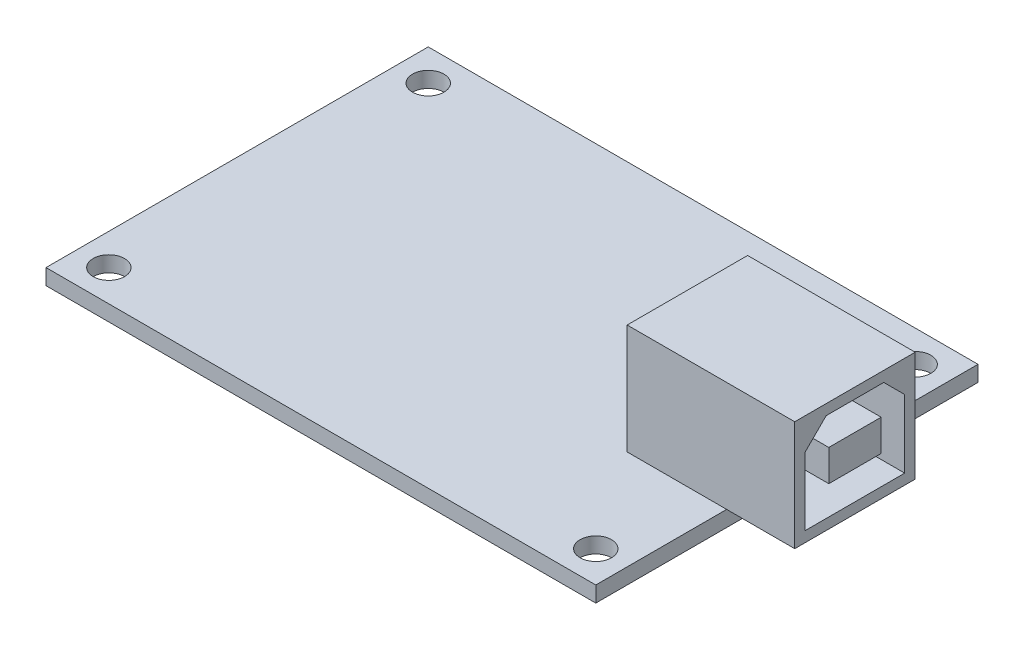
ISO-10303-21;
HEADER;
FILE_DESCRIPTION(('STEP AP214'),'2;1');
FILE_NAME('part.step','',(''),(''),'','','');
FILE_SCHEMA(('AUTOMOTIVE_DESIGN { 1 0 10303 214 1 1 1 1 }'));
ENDSEC;
DATA;
#1=APPLICATION_CONTEXT('core data for automotive mechanical design processes');
#2=APPLICATION_PROTOCOL_DEFINITION('international standard','automotive_design',2000,#1);
#3=PRODUCT_CONTEXT('',#1,'mechanical');
#4=PRODUCT('Part','Part','',(#3));
#5=PRODUCT_RELATED_PRODUCT_CATEGORY('part','',(#4));
#6=PRODUCT_DEFINITION_FORMATION('','',#4);
#7=PRODUCT_DEFINITION_CONTEXT('part definition',#1,'design');
#8=PRODUCT_DEFINITION('design','',#6,#7);
#9=PRODUCT_DEFINITION_SHAPE('','',#8);
#10=(LENGTH_UNIT() NAMED_UNIT(*) SI_UNIT(.MILLI.,.METRE.));
#11=(NAMED_UNIT(*) PLANE_ANGLE_UNIT() SI_UNIT($,.RADIAN.));
#12=(NAMED_UNIT(*) SI_UNIT($,.STERADIAN.) SOLID_ANGLE_UNIT());
#13=UNCERTAINTY_MEASURE_WITH_UNIT(LENGTH_MEASURE(1.E-05),#10,'distance_accuracy_value','');
#14=(GEOMETRIC_REPRESENTATION_CONTEXT(3) GLOBAL_UNCERTAINTY_ASSIGNED_CONTEXT((#13)) GLOBAL_UNIT_ASSIGNED_CONTEXT((#10,
#11,#12)) REPRESENTATION_CONTEXT('',''));
#15=CARTESIAN_POINT('',(0.,0.,0.));
#16=DIRECTION('',(0.,0.,1.));
#17=DIRECTION('',(1.,0.,0.));
#18=AXIS2_PLACEMENT_3D('',#15,#16,#17);
#19=CARTESIAN_POINT('',(0.,1.5,0.));
#20=DIRECTION('',(0.,1.,0.));
#21=DIRECTION('',(0.,0.,1.));
#22=AXIS2_PLACEMENT_3D('',#19,#20,#21);
#23=PLANE('',#22);
#24=DIRECTION('',(1.,0.,0.));
#25=VECTOR('',#24,1.);
#26=CARTESIAN_POINT('',(16.75,1.5,5.75));
#27=LINE('',#26,#25);
#28=CARTESIAN_POINT('',(16.75,1.5,5.75));
#29=VERTEX_POINT('',#28);
#30=CARTESIAN_POINT('',(26.25,1.5,5.75));
#31=VERTEX_POINT('',#30);
#32=EDGE_CURVE('E260',#29,#31,#27,.T.);
#33=ORIENTED_EDGE('',*,*,#32,.F.);
#34=DIRECTION('',(0.,0.,1.));
#35=VECTOR('',#34,1.);
#36=CARTESIAN_POINT('',(16.75,1.5,-5.75));
#37=LINE('',#36,#35);
#38=CARTESIAN_POINT('',(16.75,1.5,-5.75));
#39=VERTEX_POINT('',#38);
#40=EDGE_CURVE('E270',#39,#29,#37,.T.);
#41=ORIENTED_EDGE('',*,*,#40,.F.);
#42=DIRECTION('',(-1.,0.,0.));
#43=VECTOR('',#42,1.);
#44=CARTESIAN_POINT('',(16.75,1.5,-5.75));
#45=LINE('',#44,#43);
#46=CARTESIAN_POINT('',(26.25,1.5,-5.75));
#47=VERTEX_POINT('',#46);
#48=EDGE_CURVE('E11',#47,#39,#45,.T.);
#49=ORIENTED_EDGE('',*,*,#48,.F.);
#50=DIRECTION('',(0.,0.,-1.));
#51=VECTOR('',#50,1.);
#52=CARTESIAN_POINT('',(26.25,1.5,-18.25));
#53=LINE('',#52,#51);
#54=CARTESIAN_POINT('',(26.25,1.5,-18.25));
#55=VERTEX_POINT('',#54);
#56=EDGE_CURVE('E317',#47,#55,#53,.T.);
#57=ORIENTED_EDGE('',*,*,#56,.T.);
#58=DIRECTION('',(-1.,0.,0.));
#59=VECTOR('',#58,1.);
#60=CARTESIAN_POINT('',(-26.25,1.5,-18.25));
#61=LINE('',#60,#59);
#62=CARTESIAN_POINT('',(-26.25,1.5,-18.25));
#63=VERTEX_POINT('',#62);
#64=EDGE_CURVE('E315',#55,#63,#61,.T.);
#65=ORIENTED_EDGE('',*,*,#64,.T.);
#66=DIRECTION('',(0.,0.,1.));
#67=VECTOR('',#66,1.);
#68=CARTESIAN_POINT('',(-26.25,1.5,-18.25));
#69=LINE('',#68,#67);
#70=CARTESIAN_POINT('',(-26.25,1.5,18.25));
#71=VERTEX_POINT('',#70);
#72=EDGE_CURVE('E319',#63,#71,#69,.T.);
#73=ORIENTED_EDGE('',*,*,#72,.T.);
#74=DIRECTION('',(1.,0.,0.));
#75=VECTOR('',#74,1.);
#76=CARTESIAN_POINT('',(-26.25,1.5,18.25));
#77=LINE('',#76,#75);
#78=CARTESIAN_POINT('',(26.25,1.5,18.25));
#79=VERTEX_POINT('',#78);
#80=EDGE_CURVE('E321',#71,#79,#77,.T.);
#81=ORIENTED_EDGE('',*,*,#80,.T.);
#82=EDGE_CURVE('E312',#79,#31,#53,.T.);
#83=ORIENTED_EDGE('',*,*,#82,.T.);
#84=EDGE_LOOP('',(#33,#41,#49,#57,#65,#73,#81,#83));
#85=FACE_BOUND('',#84,.T.);
#86=CARTESIAN_POINT('',(-23.25,1.5,15.25));
#87=DIRECTION('',(0.,1.,0.));
#88=DIRECTION('',(0.,0.,1.));
#89=AXIS2_PLACEMENT_3D('',#86,#87,#88);
#90=CIRCLE('',#89,1.5);
#91=CARTESIAN_POINT('',(-23.25,1.5,16.75));
#92=VERTEX_POINT('',#91);
#93=EDGE_CURVE('E294',#92,#92,#90,.T.);
#94=ORIENTED_EDGE('',*,*,#93,.F.);
#95=EDGE_LOOP('',(#94));
#96=FACE_BOUND('',#95,.T.);
#97=CARTESIAN_POINT('',(-23.25,1.5,-15.25));
#98=DIRECTION('',(0.,1.,0.));
#99=DIRECTION('',(0.,0.,1.));
#100=AXIS2_PLACEMENT_3D('',#97,#98,#99);
#101=CIRCLE('',#100,1.5);
#102=CARTESIAN_POINT('',(-23.25,1.5,-13.75));
#103=VERTEX_POINT('',#102);
#104=EDGE_CURVE('E306',#103,#103,#101,.T.);
#105=ORIENTED_EDGE('',*,*,#104,.F.);
#106=EDGE_LOOP('',(#105));
#107=FACE_BOUND('',#106,.T.);
#108=CARTESIAN_POINT('',(23.25,1.5,-15.25));
#109=DIRECTION('',(0.,1.,0.));
#110=DIRECTION('',(0.,0.,1.));
#111=AXIS2_PLACEMENT_3D('',#108,#109,#110);
#112=CIRCLE('',#111,1.5);
#113=CARTESIAN_POINT('',(23.25,1.5,-13.75));
#114=VERTEX_POINT('',#113);
#115=EDGE_CURVE('E300',#114,#114,#112,.T.);
#116=ORIENTED_EDGE('',*,*,#115,.F.);
#117=EDGE_LOOP('',(#116));
#118=FACE_BOUND('',#117,.T.);
#119=CARTESIAN_POINT('',(23.25,1.5,15.25));
#120=DIRECTION('',(0.,1.,0.));
#121=DIRECTION('',(0.,0.,1.));
#122=AXIS2_PLACEMENT_3D('',#119,#120,#121);
#123=CIRCLE('',#122,1.5);
#124=CARTESIAN_POINT('',(23.25,1.5,16.75));
#125=VERTEX_POINT('',#124);
#126=EDGE_CURVE('E288',#125,#125,#123,.T.);
#127=ORIENTED_EDGE('',*,*,#126,.F.);
#128=EDGE_LOOP('',(#127));
#129=FACE_BOUND('',#128,.T.);
#130=ADVANCED_FACE('F35',(#85,#96,#107,#118,#129),#23,.T.);
#131=CARTESIAN_POINT('',(0.,0.,0.));
#132=DIRECTION('',(0.,1.,0.));
#133=DIRECTION('',(0.,0.,1.));
#134=AXIS2_PLACEMENT_3D('',#131,#132,#133);
#135=PLANE('',#134);
#136=DIRECTION('',(0.,0.,-1.));
#137=VECTOR('',#136,1.);
#138=CARTESIAN_POINT('',(26.25,0.,-18.25));
#139=LINE('',#138,#137);
#140=CARTESIAN_POINT('',(26.25,0.,18.25));
#141=VERTEX_POINT('',#140);
#142=CARTESIAN_POINT('',(26.25,0.,-18.25));
#143=VERTEX_POINT('',#142);
#144=EDGE_CURVE('E309',#141,#143,#139,.T.);
#145=ORIENTED_EDGE('',*,*,#144,.F.);
#146=DIRECTION('',(1.,0.,0.));
#147=VECTOR('',#146,1.);
#148=CARTESIAN_POINT('',(-26.25,0.,18.25));
#149=LINE('',#148,#147);
#150=CARTESIAN_POINT('',(-26.25,0.,18.25));
#151=VERTEX_POINT('',#150);
#152=EDGE_CURVE('E330',#151,#141,#149,.T.);
#153=ORIENTED_EDGE('',*,*,#152,.F.);
#154=DIRECTION('',(0.,0.,1.));
#155=VECTOR('',#154,1.);
#156=CARTESIAN_POINT('',(-26.25,0.,-18.25));
#157=LINE('',#156,#155);
#158=CARTESIAN_POINT('',(-26.25,0.,-18.25));
#159=VERTEX_POINT('',#158);
#160=EDGE_CURVE('E328',#159,#151,#157,.T.);
#161=ORIENTED_EDGE('',*,*,#160,.F.);
#162=DIRECTION('',(-1.,0.,0.));
#163=VECTOR('',#162,1.);
#164=CARTESIAN_POINT('',(-26.25,0.,-18.25));
#165=LINE('',#164,#163);
#166=EDGE_CURVE('E326',#143,#159,#165,.T.);
#167=ORIENTED_EDGE('',*,*,#166,.F.);
#168=EDGE_LOOP('',(#145,#153,#161,#167));
#169=FACE_BOUND('',#168,.T.);
#170=CARTESIAN_POINT('',(-23.25,0.,-15.25));
#171=DIRECTION('',(0.,1.,0.));
#172=DIRECTION('',(0.,0.,1.));
#173=AXIS2_PLACEMENT_3D('',#170,#171,#172);
#174=CIRCLE('',#173,1.5);
#175=CARTESIAN_POINT('',(-23.25,0.,-13.75));
#176=VERTEX_POINT('',#175);
#177=EDGE_CURVE('E303',#176,#176,#174,.T.);
#178=ORIENTED_EDGE('',*,*,#177,.T.);
#179=EDGE_LOOP('',(#178));
#180=FACE_BOUND('',#179,.T.);
#181=CARTESIAN_POINT('',(23.25,0.,-15.25));
#182=DIRECTION('',(0.,1.,0.));
#183=DIRECTION('',(0.,0.,1.));
#184=AXIS2_PLACEMENT_3D('',#181,#182,#183);
#185=CIRCLE('',#184,1.5);
#186=CARTESIAN_POINT('',(23.25,0.,-13.75));
#187=VERTEX_POINT('',#186);
#188=EDGE_CURVE('E297',#187,#187,#185,.T.);
#189=ORIENTED_EDGE('',*,*,#188,.T.);
#190=EDGE_LOOP('',(#189));
#191=FACE_BOUND('',#190,.T.);
#192=CARTESIAN_POINT('',(-23.25,0.,15.25));
#193=DIRECTION('',(0.,1.,0.));
#194=DIRECTION('',(0.,0.,1.));
#195=AXIS2_PLACEMENT_3D('',#192,#193,#194);
#196=CIRCLE('',#195,1.5);
#197=CARTESIAN_POINT('',(-23.25,0.,16.75));
#198=VERTEX_POINT('',#197);
#199=EDGE_CURVE('E291',#198,#198,#196,.T.);
#200=ORIENTED_EDGE('',*,*,#199,.T.);
#201=EDGE_LOOP('',(#200));
#202=FACE_BOUND('',#201,.T.);
#203=CARTESIAN_POINT('',(23.25,0.,15.25));
#204=DIRECTION('',(0.,1.,0.));
#205=DIRECTION('',(0.,0.,1.));
#206=AXIS2_PLACEMENT_3D('',#203,#204,#205);
#207=CIRCLE('',#206,1.5);
#208=CARTESIAN_POINT('',(23.25,0.,16.75));
#209=VERTEX_POINT('',#208);
#210=EDGE_CURVE('E287',#209,#209,#207,.T.);
#211=ORIENTED_EDGE('',*,*,#210,.T.);
#212=EDGE_LOOP('',(#211));
#213=FACE_BOUND('',#212,.T.);
#214=ADVANCED_FACE('F354',(#169,#180,#191,#202,#213),#135,.F.);
#215=CARTESIAN_POINT('',(26.25,1.5,-18.25));
#216=DIRECTION('',(-1.,0.,0.));
#217=DIRECTION('',(0.,0.,1.));
#218=AXIS2_PLACEMENT_3D('',#215,#216,#217);
#219=PLANE('',#218);
#220=ORIENTED_EDGE('',*,*,#144,.T.);
#221=DIRECTION('',(0.,-1.,0.));
#222=VECTOR('',#221,1.);
#223=CARTESIAN_POINT('',(26.25,1.5,-18.25));
#224=LINE('',#223,#222);
#225=EDGE_CURVE('E39',#55,#143,#224,.T.);
#226=ORIENTED_EDGE('',*,*,#225,.F.);
#227=ORIENTED_EDGE('',*,*,#56,.F.);
#228=EDGE_CURVE('E316',#31,#47,#53,.T.);
#229=ORIENTED_EDGE('',*,*,#228,.F.);
#230=ORIENTED_EDGE('',*,*,#82,.F.);
#231=DIRECTION('',(0.,-1.,0.));
#232=VECTOR('',#231,1.);
#233=CARTESIAN_POINT('',(26.25,1.5,18.25));
#234=LINE('',#233,#232);
#235=EDGE_CURVE('E323',#79,#141,#234,.T.);
#236=ORIENTED_EDGE('',*,*,#235,.T.);
#237=EDGE_LOOP('',(#220,#226,#227,#229,#230,#236));
#238=FACE_BOUND('',#237,.T.);
#239=ADVANCED_FACE('F37',(#238),#219,.F.);
#240=CARTESIAN_POINT('',(-26.25,1.5,-18.25));
#241=DIRECTION('',(0.,0.,1.));
#242=DIRECTION('',(1.,0.,0.));
#243=AXIS2_PLACEMENT_3D('',#240,#241,#242);
#244=PLANE('',#243);
#245=ORIENTED_EDGE('',*,*,#166,.T.);
#246=DIRECTION('',(0.,-1.,0.));
#247=VECTOR('',#246,1.);
#248=CARTESIAN_POINT('',(-26.25,1.5,-18.25));
#249=LINE('',#248,#247);
#250=EDGE_CURVE('E336',#63,#159,#249,.T.);
#251=ORIENTED_EDGE('',*,*,#250,.F.);
#252=ORIENTED_EDGE('',*,*,#64,.F.);
#253=ORIENTED_EDGE('',*,*,#225,.T.);
#254=EDGE_LOOP('',(#245,#251,#252,#253));
#255=FACE_BOUND('',#254,.T.);
#256=ADVANCED_FACE('F346',(#255),#244,.F.);
#257=CARTESIAN_POINT('',(-26.25,1.5,-18.25));
#258=DIRECTION('',(1.,0.,0.));
#259=DIRECTION('',(0.,0.,-1.));
#260=AXIS2_PLACEMENT_3D('',#257,#258,#259);
#261=PLANE('',#260);
#262=ORIENTED_EDGE('',*,*,#160,.T.);
#263=DIRECTION('',(0.,-1.,0.));
#264=VECTOR('',#263,1.);
#265=CARTESIAN_POINT('',(-26.25,1.5,18.25));
#266=LINE('',#265,#264);
#267=EDGE_CURVE('E334',#71,#151,#266,.T.);
#268=ORIENTED_EDGE('',*,*,#267,.F.);
#269=ORIENTED_EDGE('',*,*,#72,.F.);
#270=ORIENTED_EDGE('',*,*,#250,.T.);
#271=EDGE_LOOP('',(#262,#268,#269,#270));
#272=FACE_BOUND('',#271,.T.);
#273=ADVANCED_FACE('F357',(#272),#261,.F.);
#274=CARTESIAN_POINT('',(-26.25,1.5,18.25));
#275=DIRECTION('',(0.,0.,-1.));
#276=DIRECTION('',(-1.,0.,0.));
#277=AXIS2_PLACEMENT_3D('',#274,#275,#276);
#278=PLANE('',#277);
#279=ORIENTED_EDGE('',*,*,#152,.T.);
#280=ORIENTED_EDGE('',*,*,#235,.F.);
#281=ORIENTED_EDGE('',*,*,#80,.F.);
#282=ORIENTED_EDGE('',*,*,#267,.T.);
#283=EDGE_LOOP('',(#279,#280,#281,#282));
#284=FACE_BOUND('',#283,.T.);
#285=ADVANCED_FACE('F360',(#284),#278,.F.);
#286=CARTESIAN_POINT('',(-23.25,1.5,-15.25));
#287=DIRECTION('',(0.,-1.,0.));
#288=DIRECTION('',(0.,0.,-1.));
#289=AXIS2_PLACEMENT_3D('',#286,#287,#288);
#290=CYLINDRICAL_SURFACE('',#289,1.5);
#291=ORIENTED_EDGE('',*,*,#104,.T.);
#292=EDGE_LOOP('',(#291));
#293=FACE_BOUND('',#292,.T.);
#294=ORIENTED_EDGE('',*,*,#177,.F.);
#295=EDGE_LOOP('',(#294));
#296=FACE_BOUND('',#295,.T.);
#297=ADVANCED_FACE('F404',(#293,#296),#290,.F.);
#298=CARTESIAN_POINT('',(23.25,1.5,-15.25));
#299=DIRECTION('',(0.,-1.,0.));
#300=DIRECTION('',(0.,0.,-1.));
#301=AXIS2_PLACEMENT_3D('',#298,#299,#300);
#302=CYLINDRICAL_SURFACE('',#301,1.5);
#303=ORIENTED_EDGE('',*,*,#115,.T.);
#304=EDGE_LOOP('',(#303));
#305=FACE_BOUND('',#304,.T.);
#306=ORIENTED_EDGE('',*,*,#188,.F.);
#307=EDGE_LOOP('',(#306));
#308=FACE_BOUND('',#307,.T.);
#309=ADVANCED_FACE('F447',(#305,#308),#302,.F.);
#310=CARTESIAN_POINT('',(-23.25,1.5,15.25));
#311=DIRECTION('',(0.,-1.,0.));
#312=DIRECTION('',(0.,0.,-1.));
#313=AXIS2_PLACEMENT_3D('',#310,#311,#312);
#314=CYLINDRICAL_SURFACE('',#313,1.5);
#315=ORIENTED_EDGE('',*,*,#93,.T.);
#316=EDGE_LOOP('',(#315));
#317=FACE_BOUND('',#316,.T.);
#318=ORIENTED_EDGE('',*,*,#199,.F.);
#319=EDGE_LOOP('',(#318));
#320=FACE_BOUND('',#319,.T.);
#321=ADVANCED_FACE('F456',(#317,#320),#314,.F.);
#322=CARTESIAN_POINT('',(23.25,1.5,15.25));
#323=DIRECTION('',(0.,-1.,0.));
#324=DIRECTION('',(0.,0.,-1.));
#325=AXIS2_PLACEMENT_3D('',#322,#323,#324);
#326=CYLINDRICAL_SURFACE('',#325,1.5);
#327=ORIENTED_EDGE('',*,*,#126,.T.);
#328=EDGE_LOOP('',(#327));
#329=FACE_BOUND('',#328,.T.);
#330=ORIENTED_EDGE('',*,*,#210,.F.);
#331=EDGE_LOOP('',(#330));
#332=FACE_BOUND('',#331,.T.);
#333=ADVANCED_FACE('F465',(#329,#332),#326,.F.);
#334=CARTESIAN_POINT('',(0.,1.5,0.));
#335=DIRECTION('',(0.,1.,0.));
#336=DIRECTION('',(0.,0.,1.));
#337=AXIS2_PLACEMENT_3D('',#334,#335,#336);
#338=PLANE('',#337);
#339=CARTESIAN_POINT('',(32.75,1.5,5.75));
#340=VERTEX_POINT('',#339);
#341=EDGE_CURVE('E273',#31,#340,#27,.T.);
#342=ORIENTED_EDGE('',*,*,#341,.F.);
#343=ORIENTED_EDGE('',*,*,#228,.T.);
#344=CARTESIAN_POINT('',(32.75,1.5,-5.75));
#345=VERTEX_POINT('',#344);
#346=EDGE_CURVE('E45',#345,#47,#45,.T.);
#347=ORIENTED_EDGE('',*,*,#346,.F.);
#348=DIRECTION('',(0.,0.,-1.));
#349=VECTOR('',#348,1.);
#350=CARTESIAN_POINT('',(32.75,1.5,-5.75));
#351=LINE('',#350,#349);
#352=EDGE_CURVE('E246',#340,#345,#351,.T.);
#353=ORIENTED_EDGE('',*,*,#352,.F.);
#354=EDGE_LOOP('',(#342,#343,#347,#353));
#355=FACE_BOUND('',#354,.T.);
#356=ADVANCED_FACE('F366',(#355),#338,.F.);
#357=CARTESIAN_POINT('',(32.75,12.,-5.75));
#358=DIRECTION('',(-1.,0.,0.));
#359=DIRECTION('',(0.,0.,1.));
#360=AXIS2_PLACEMENT_3D('',#357,#358,#359);
#361=PLANE('',#360);
#362=DIRECTION('',(0.,0.,-1.));
#363=VECTOR('',#362,1.);
#364=CARTESIAN_POINT('',(32.75,2.5,4.75));
#365=LINE('',#364,#363);
#366=CARTESIAN_POINT('',(32.75,2.5,4.75));
#367=VERTEX_POINT('',#366);
#368=CARTESIAN_POINT('',(32.75,2.5,-4.75));
#369=VERTEX_POINT('',#368);
#370=EDGE_CURVE('E230',#367,#369,#365,.T.);
#371=ORIENTED_EDGE('',*,*,#370,.F.);
#372=DIRECTION('',(0.,-1.,0.));
#373=VECTOR('',#372,1.);
#374=CARTESIAN_POINT('',(32.75,9.,4.75));
#375=LINE('',#374,#373);
#376=CARTESIAN_POINT('',(32.75,9.,4.75));
#377=VERTEX_POINT('',#376);
#378=EDGE_CURVE('E52',#377,#367,#375,.T.);
#379=ORIENTED_EDGE('',*,*,#378,.F.);
#380=DIRECTION('',(0.,-0.707106781186548,0.707106781186547));
#381=VECTOR('',#380,1.);
#382=CARTESIAN_POINT('',(32.75,11.,2.75));
#383=LINE('',#382,#381);
#384=CARTESIAN_POINT('',(32.75,11.,2.75));
#385=VERTEX_POINT('',#384);
#386=EDGE_CURVE('E213',#385,#377,#383,.T.);
#387=ORIENTED_EDGE('',*,*,#386,.F.);
#388=DIRECTION('',(0.,0.,1.));
#389=VECTOR('',#388,1.);
#390=CARTESIAN_POINT('',(32.75,11.,-2.75));
#391=LINE('',#390,#389);
#392=CARTESIAN_POINT('',(32.75,11.,-2.75));
#393=VERTEX_POINT('',#392);
#394=EDGE_CURVE('E239',#393,#385,#391,.T.);
#395=ORIENTED_EDGE('',*,*,#394,.F.);
#396=DIRECTION('',(0.,0.707106781186547,0.707106781186548));
#397=VECTOR('',#396,1.);
#398=CARTESIAN_POINT('',(32.75,9.,-4.75));
#399=LINE('',#398,#397);
#400=CARTESIAN_POINT('',(32.75,9.,-4.75));
#401=VERTEX_POINT('',#400);
#402=EDGE_CURVE('E236',#401,#393,#399,.T.);
#403=ORIENTED_EDGE('',*,*,#402,.F.);
#404=DIRECTION('',(0.,1.,0.));
#405=VECTOR('',#404,1.);
#406=CARTESIAN_POINT('',(32.75,2.5,-4.75));
#407=LINE('',#406,#405);
#408=EDGE_CURVE('E233',#369,#401,#407,.T.);
#409=ORIENTED_EDGE('',*,*,#408,.F.);
#410=EDGE_LOOP('',(#371,#379,#387,#395,#403,#409));
#411=FACE_BOUND('',#410,.T.);
#412=ORIENTED_EDGE('',*,*,#352,.T.);
#413=DIRECTION('',(0.,-1.,0.));
#414=VECTOR('',#413,1.);
#415=CARTESIAN_POINT('',(32.75,12.,-5.75));
#416=LINE('',#415,#414);
#417=CARTESIAN_POINT('',(32.75,12.,-5.75));
#418=VERTEX_POINT('',#417);
#419=EDGE_CURVE('E284',#418,#345,#416,.T.);
#420=ORIENTED_EDGE('',*,*,#419,.F.);
#421=DIRECTION('',(0.,0.,-1.));
#422=VECTOR('',#421,1.);
#423=CARTESIAN_POINT('',(32.75,12.,-5.75));
#424=LINE('',#423,#422);
#425=CARTESIAN_POINT('',(32.75,12.,5.75));
#426=VERTEX_POINT('',#425);
#427=EDGE_CURVE('E256',#426,#418,#424,.T.);
#428=ORIENTED_EDGE('',*,*,#427,.F.);
#429=DIRECTION('',(0.,-1.,0.));
#430=VECTOR('',#429,1.);
#431=CARTESIAN_POINT('',(32.75,12.,5.75));
#432=LINE('',#431,#430);
#433=EDGE_CURVE('E266',#426,#340,#432,.T.);
#434=ORIENTED_EDGE('',*,*,#433,.T.);
#435=EDGE_LOOP('',(#412,#420,#428,#434));
#436=FACE_BOUND('',#435,.T.);
#437=ADVANCED_FACE('F374',(#411,#436),#361,.F.);
#438=CARTESIAN_POINT('',(16.75,12.,-5.75));
#439=DIRECTION('',(0.,0.,1.));
#440=DIRECTION('',(1.,0.,0.));
#441=AXIS2_PLACEMENT_3D('',#438,#439,#440);
#442=PLANE('',#441);
#443=ORIENTED_EDGE('',*,*,#346,.T.);
#444=ORIENTED_EDGE('',*,*,#48,.T.);
#445=DIRECTION('',(0.,-1.,0.));
#446=VECTOR('',#445,1.);
#447=CARTESIAN_POINT('',(16.75,12.,-5.75));
#448=LINE('',#447,#446);
#449=CARTESIAN_POINT('',(16.75,12.,-5.75));
#450=VERTEX_POINT('',#449);
#451=EDGE_CURVE('E281',#450,#39,#448,.T.);
#452=ORIENTED_EDGE('',*,*,#451,.F.);
#453=DIRECTION('',(-1.,0.,0.));
#454=VECTOR('',#453,1.);
#455=CARTESIAN_POINT('',(16.75,12.,-5.75));
#456=LINE('',#455,#454);
#457=EDGE_CURVE('E259',#418,#450,#456,.T.);
#458=ORIENTED_EDGE('',*,*,#457,.F.);
#459=ORIENTED_EDGE('',*,*,#419,.T.);
#460=EDGE_LOOP('',(#443,#444,#452,#458,#459));
#461=FACE_BOUND('',#460,.T.);
#462=ADVANCED_FACE('F369',(#461),#442,.F.);
#463=CARTESIAN_POINT('',(16.75,12.,-5.75));
#464=DIRECTION('',(1.,0.,0.));
#465=DIRECTION('',(0.,0.,-1.));
#466=AXIS2_PLACEMENT_3D('',#463,#464,#465);
#467=PLANE('',#466);
#468=ORIENTED_EDGE('',*,*,#40,.T.);
#469=DIRECTION('',(0.,-1.,0.));
#470=VECTOR('',#469,1.);
#471=CARTESIAN_POINT('',(16.75,12.,5.75));
#472=LINE('',#471,#470);
#473=CARTESIAN_POINT('',(16.75,12.,5.75));
#474=VERTEX_POINT('',#473);
#475=EDGE_CURVE('E278',#474,#29,#472,.T.);
#476=ORIENTED_EDGE('',*,*,#475,.F.);
#477=DIRECTION('',(0.,0.,1.));
#478=VECTOR('',#477,1.);
#479=CARTESIAN_POINT('',(16.75,12.,-5.75));
#480=LINE('',#479,#478);
#481=EDGE_CURVE('E262',#450,#474,#480,.T.);
#482=ORIENTED_EDGE('',*,*,#481,.F.);
#483=ORIENTED_EDGE('',*,*,#451,.T.);
#484=EDGE_LOOP('',(#468,#476,#482,#483));
#485=FACE_BOUND('',#484,.T.);
#486=ADVANCED_FACE('F381',(#485),#467,.F.);
#487=CARTESIAN_POINT('',(16.75,12.,5.75));
#488=DIRECTION('',(0.,0.,-1.));
#489=DIRECTION('',(-1.,0.,0.));
#490=AXIS2_PLACEMENT_3D('',#487,#488,#489);
#491=PLANE('',#490);
#492=ORIENTED_EDGE('',*,*,#32,.T.);
#493=ORIENTED_EDGE('',*,*,#341,.T.);
#494=ORIENTED_EDGE('',*,*,#433,.F.);
#495=DIRECTION('',(1.,0.,0.));
#496=VECTOR('',#495,1.);
#497=CARTESIAN_POINT('',(16.75,12.,5.75));
#498=LINE('',#497,#496);
#499=EDGE_CURVE('E264',#474,#426,#498,.T.);
#500=ORIENTED_EDGE('',*,*,#499,.F.);
#501=ORIENTED_EDGE('',*,*,#475,.T.);
#502=EDGE_LOOP('',(#492,#493,#494,#500,#501));
#503=FACE_BOUND('',#502,.T.);
#504=ADVANCED_FACE('F378',(#503),#491,.F.);
#505=CARTESIAN_POINT('',(0.,12.,0.));
#506=DIRECTION('',(0.,1.,0.));
#507=DIRECTION('',(0.,0.,1.));
#508=AXIS2_PLACEMENT_3D('',#505,#506,#507);
#509=PLANE('',#508);
#510=ORIENTED_EDGE('',*,*,#427,.T.);
#511=ORIENTED_EDGE('',*,*,#457,.T.);
#512=ORIENTED_EDGE('',*,*,#481,.T.);
#513=ORIENTED_EDGE('',*,*,#499,.T.);
#514=EDGE_LOOP('',(#510,#511,#512,#513));
#515=FACE_BOUND('',#514,.T.);
#516=ADVANCED_FACE('F384',(#515),#509,.T.);
#517=CARTESIAN_POINT('',(22.75,9.,4.75));
#518=DIRECTION('',(0.,0.,1.));
#519=DIRECTION('',(0.,-1.,0.));
#520=AXIS2_PLACEMENT_3D('',#517,#518,#519);
#521=PLANE('',#520);
#522=ORIENTED_EDGE('',*,*,#378,.T.);
#523=DIRECTION('',(1.,0.,0.));
#524=VECTOR('',#523,1.);
#525=CARTESIAN_POINT('',(22.75,2.5,4.75));
#526=LINE('',#525,#524);
#527=CARTESIAN_POINT('',(22.75,2.5,4.75));
#528=VERTEX_POINT('',#527);
#529=EDGE_CURVE('E228',#528,#367,#526,.T.);
#530=ORIENTED_EDGE('',*,*,#529,.F.);
#531=DIRECTION('',(0.,-1.,0.));
#532=VECTOR('',#531,1.);
#533=CARTESIAN_POINT('',(22.75,9.,4.75));
#534=LINE('',#533,#532);
#535=CARTESIAN_POINT('',(22.75,9.,4.75));
#536=VERTEX_POINT('',#535);
#537=EDGE_CURVE('E209',#536,#528,#534,.T.);
#538=ORIENTED_EDGE('',*,*,#537,.F.);
#539=DIRECTION('',(1.,0.,0.));
#540=VECTOR('',#539,1.);
#541=CARTESIAN_POINT('',(22.75,9.,4.75));
#542=LINE('',#541,#540);
#543=EDGE_CURVE('E244',#536,#377,#542,.T.);
#544=ORIENTED_EDGE('',*,*,#543,.T.);
#545=EDGE_LOOP('',(#522,#530,#538,#544));
#546=FACE_BOUND('',#545,.T.);
#547=ADVANCED_FACE('F386',(#546),#521,.F.);
#548=CARTESIAN_POINT('',(22.75,11.,2.75));
#549=DIRECTION('',(0.,0.707106781186547,0.707106781186548));
#550=DIRECTION('',(0.,-0.707106781186548,0.707106781186547));
#551=AXIS2_PLACEMENT_3D('',#548,#549,#550);
#552=PLANE('',#551);
#553=ORIENTED_EDGE('',*,*,#386,.T.);
#554=ORIENTED_EDGE('',*,*,#543,.F.);
#555=DIRECTION('',(0.,-0.707106781186548,0.707106781186547));
#556=VECTOR('',#555,1.);
#557=CARTESIAN_POINT('',(22.75,11.,2.75));
#558=LINE('',#557,#556);
#559=CARTESIAN_POINT('',(22.75,11.,2.75));
#560=VERTEX_POINT('',#559);
#561=EDGE_CURVE('E225',#560,#536,#558,.T.);
#562=ORIENTED_EDGE('',*,*,#561,.F.);
#563=DIRECTION('',(1.,0.,0.));
#564=VECTOR('',#563,1.);
#565=CARTESIAN_POINT('',(22.75,11.,2.75));
#566=LINE('',#565,#564);
#567=EDGE_CURVE('E247',#560,#385,#566,.T.);
#568=ORIENTED_EDGE('',*,*,#567,.T.);
#569=EDGE_LOOP('',(#553,#554,#562,#568));
#570=FACE_BOUND('',#569,.T.);
#571=ADVANCED_FACE('F393',(#570),#552,.F.);
#572=CARTESIAN_POINT('',(22.75,11.,-2.75));
#573=DIRECTION('',(0.,1.,0.));
#574=DIRECTION('',(0.,0.,1.));
#575=AXIS2_PLACEMENT_3D('',#572,#573,#574);
#576=PLANE('',#575);
#577=ORIENTED_EDGE('',*,*,#394,.T.);
#578=ORIENTED_EDGE('',*,*,#567,.F.);
#579=DIRECTION('',(0.,0.,1.));
#580=VECTOR('',#579,1.);
#581=CARTESIAN_POINT('',(22.75,11.,-2.75));
#582=LINE('',#581,#580);
#583=CARTESIAN_POINT('',(22.75,11.,-2.75));
#584=VERTEX_POINT('',#583);
#585=EDGE_CURVE('E222',#584,#560,#582,.T.);
#586=ORIENTED_EDGE('',*,*,#585,.F.);
#587=DIRECTION('',(1.,0.,0.));
#588=VECTOR('',#587,1.);
#589=CARTESIAN_POINT('',(22.75,11.,-2.75));
#590=LINE('',#589,#588);
#591=EDGE_CURVE('E249',#584,#393,#590,.T.);
#592=ORIENTED_EDGE('',*,*,#591,.T.);
#593=EDGE_LOOP('',(#577,#578,#586,#592));
#594=FACE_BOUND('',#593,.T.);
#595=ADVANCED_FACE('F537',(#594),#576,.F.);
#596=CARTESIAN_POINT('',(22.75,9.,-4.75));
#597=DIRECTION('',(0.,0.707106781186548,-0.707106781186547));
#598=DIRECTION('',(0.,0.707106781186547,0.707106781186548));
#599=AXIS2_PLACEMENT_3D('',#596,#597,#598);
#600=PLANE('',#599);
#601=ORIENTED_EDGE('',*,*,#402,.T.);
#602=ORIENTED_EDGE('',*,*,#591,.F.);
#603=DIRECTION('',(0.,0.707106781186547,0.707106781186548));
#604=VECTOR('',#603,1.);
#605=CARTESIAN_POINT('',(22.75,9.,-4.75));
#606=LINE('',#605,#604);
#607=CARTESIAN_POINT('',(22.75,9.,-4.75));
#608=VERTEX_POINT('',#607);
#609=EDGE_CURVE('E219',#608,#584,#606,.T.);
#610=ORIENTED_EDGE('',*,*,#609,.F.);
#611=DIRECTION('',(1.,0.,0.));
#612=VECTOR('',#611,1.);
#613=CARTESIAN_POINT('',(22.75,9.,-4.75));
#614=LINE('',#613,#612);
#615=EDGE_CURVE('E251',#608,#401,#614,.T.);
#616=ORIENTED_EDGE('',*,*,#615,.T.);
#617=EDGE_LOOP('',(#601,#602,#610,#616));
#618=FACE_BOUND('',#617,.T.);
#619=ADVANCED_FACE('F546',(#618),#600,.F.);
#620=CARTESIAN_POINT('',(22.75,2.5,-4.75));
#621=DIRECTION('',(0.,0.,-1.));
#622=DIRECTION('',(0.,1.,0.));
#623=AXIS2_PLACEMENT_3D('',#620,#621,#622);
#624=PLANE('',#623);
#625=ORIENTED_EDGE('',*,*,#408,.T.);
#626=ORIENTED_EDGE('',*,*,#615,.F.);
#627=DIRECTION('',(0.,1.,0.));
#628=VECTOR('',#627,1.);
#629=CARTESIAN_POINT('',(22.75,2.5,-4.75));
#630=LINE('',#629,#628);
#631=CARTESIAN_POINT('',(22.75,2.5,-4.75));
#632=VERTEX_POINT('',#631);
#633=EDGE_CURVE('E216',#632,#608,#630,.T.);
#634=ORIENTED_EDGE('',*,*,#633,.F.);
#635=DIRECTION('',(1.,0.,0.));
#636=VECTOR('',#635,1.);
#637=CARTESIAN_POINT('',(22.75,2.5,-4.75));
#638=LINE('',#637,#636);
#639=EDGE_CURVE('E253',#632,#369,#638,.T.);
#640=ORIENTED_EDGE('',*,*,#639,.T.);
#641=EDGE_LOOP('',(#625,#626,#634,#640));
#642=FACE_BOUND('',#641,.T.);
#643=ADVANCED_FACE('F555',(#642),#624,.F.);
#644=CARTESIAN_POINT('',(22.75,2.5,4.75));
#645=DIRECTION('',(0.,-1.,0.));
#646=DIRECTION('',(0.,0.,-1.));
#647=AXIS2_PLACEMENT_3D('',#644,#645,#646);
#648=PLANE('',#647);
#649=ORIENTED_EDGE('',*,*,#370,.T.);
#650=ORIENTED_EDGE('',*,*,#639,.F.);
#651=DIRECTION('',(0.,0.,-1.));
#652=VECTOR('',#651,1.);
#653=CARTESIAN_POINT('',(22.75,2.5,4.75));
#654=LINE('',#653,#652);
#655=EDGE_CURVE('E212',#528,#632,#654,.T.);
#656=ORIENTED_EDGE('',*,*,#655,.F.);
#657=ORIENTED_EDGE('',*,*,#529,.T.);
#658=EDGE_LOOP('',(#649,#650,#656,#657));
#659=FACE_BOUND('',#658,.T.);
#660=ADVANCED_FACE('F564',(#659),#648,.F.);
#661=CARTESIAN_POINT('',(22.75,0.,0.));
#662=DIRECTION('',(1.,0.,0.));
#663=DIRECTION('',(0.,0.,-1.));
#664=AXIS2_PLACEMENT_3D('',#661,#662,#663);
#665=PLANE('',#664);
#666=DIRECTION('',(0.,0.,-1.));
#667=VECTOR('',#666,1.);
#668=CARTESIAN_POINT('',(22.75,5.25,2.5));
#669=LINE('',#668,#667);
#670=CARTESIAN_POINT('',(22.75,5.25,2.5));
#671=VERTEX_POINT('',#670);
#672=CARTESIAN_POINT('',(22.75,5.25,-2.5));
#673=VERTEX_POINT('',#672);
#674=EDGE_CURVE('E180',#671,#673,#669,.T.);
#675=ORIENTED_EDGE('',*,*,#674,.F.);
#676=DIRECTION('',(0.,-1.,0.));
#677=VECTOR('',#676,1.);
#678=CARTESIAN_POINT('',(22.75,8.25,2.5));
#679=LINE('',#678,#677);
#680=CARTESIAN_POINT('',(22.75,8.25,2.5));
#681=VERTEX_POINT('',#680);
#682=EDGE_CURVE('E190',#681,#671,#679,.T.);
#683=ORIENTED_EDGE('',*,*,#682,.F.);
#684=DIRECTION('',(0.,0.,1.));
#685=VECTOR('',#684,1.);
#686=CARTESIAN_POINT('',(22.75,8.25,2.5));
#687=LINE('',#686,#685);
#688=CARTESIAN_POINT('',(22.75,8.25,-2.5));
#689=VERTEX_POINT('',#688);
#690=EDGE_CURVE('E172',#689,#681,#687,.T.);
#691=ORIENTED_EDGE('',*,*,#690,.F.);
#692=DIRECTION('',(0.,1.,0.));
#693=VECTOR('',#692,1.);
#694=CARTESIAN_POINT('',(22.75,8.25,-2.5));
#695=LINE('',#694,#693);
#696=EDGE_CURVE('E187',#673,#689,#695,.T.);
#697=ORIENTED_EDGE('',*,*,#696,.F.);
#698=EDGE_LOOP('',(#675,#683,#691,#697));
#699=FACE_BOUND('',#698,.T.);
#700=ORIENTED_EDGE('',*,*,#537,.T.);
#701=ORIENTED_EDGE('',*,*,#655,.T.);
#702=ORIENTED_EDGE('',*,*,#633,.T.);
#703=ORIENTED_EDGE('',*,*,#609,.T.);
#704=ORIENTED_EDGE('',*,*,#585,.T.);
#705=ORIENTED_EDGE('',*,*,#561,.T.);
#706=EDGE_LOOP('',(#700,#701,#702,#703,#704,#705));
#707=FACE_BOUND('',#706,.T.);
#708=ADVANCED_FACE('F185',(#699,#707),#665,.T.);
#709=CARTESIAN_POINT('',(22.75,8.25,-2.5));
#710=DIRECTION('',(0.,0.,-1.));
#711=DIRECTION('',(-1.,0.,0.));
#712=AXIS2_PLACEMENT_3D('',#709,#710,#711);
#713=PLANE('',#712);
#714=DIRECTION('',(0.,1.,0.));
#715=VECTOR('',#714,1.);
#716=CARTESIAN_POINT('',(32.75,8.25,-2.5));
#717=LINE('',#716,#715);
#718=CARTESIAN_POINT('',(32.75,5.25,-2.5));
#719=VERTEX_POINT('',#718);
#720=CARTESIAN_POINT('',(32.75,8.25,-2.5));
#721=VERTEX_POINT('',#720);
#722=EDGE_CURVE('E201',#719,#721,#717,.T.);
#723=ORIENTED_EDGE('',*,*,#722,.F.);
#724=DIRECTION('',(1.,0.,0.));
#725=VECTOR('',#724,1.);
#726=CARTESIAN_POINT('',(22.75,5.25,-2.5));
#727=LINE('',#726,#725);
#728=EDGE_CURVE('E193',#673,#719,#727,.T.);
#729=ORIENTED_EDGE('',*,*,#728,.F.);
#730=ORIENTED_EDGE('',*,*,#696,.T.);
#731=DIRECTION('',(1.,0.,0.));
#732=VECTOR('',#731,1.);
#733=CARTESIAN_POINT('',(22.75,8.25,-2.5));
#734=LINE('',#733,#732);
#735=EDGE_CURVE('E169',#689,#721,#734,.T.);
#736=ORIENTED_EDGE('',*,*,#735,.T.);
#737=EDGE_LOOP('',(#723,#729,#730,#736));
#738=FACE_BOUND('',#737,.T.);
#739=ADVANCED_FACE('F192',(#738),#713,.T.);
#740=CARTESIAN_POINT('',(22.75,5.25,2.5));
#741=DIRECTION('',(0.,-1.,0.));
#742=DIRECTION('',(0.,0.,-1.));
#743=AXIS2_PLACEMENT_3D('',#740,#741,#742);
#744=PLANE('',#743);
#745=DIRECTION('',(0.,0.,-1.));
#746=VECTOR('',#745,1.);
#747=CARTESIAN_POINT('',(32.75,5.25,2.5));
#748=LINE('',#747,#746);
#749=CARTESIAN_POINT('',(32.75,5.25,2.5));
#750=VERTEX_POINT('',#749);
#751=EDGE_CURVE('E194',#750,#719,#748,.T.);
#752=ORIENTED_EDGE('',*,*,#751,.F.);
#753=DIRECTION('',(1.,0.,0.));
#754=VECTOR('',#753,1.);
#755=CARTESIAN_POINT('',(22.75,5.25,2.5));
#756=LINE('',#755,#754);
#757=EDGE_CURVE('E206',#671,#750,#756,.T.);
#758=ORIENTED_EDGE('',*,*,#757,.F.);
#759=ORIENTED_EDGE('',*,*,#674,.T.);
#760=ORIENTED_EDGE('',*,*,#728,.T.);
#761=EDGE_LOOP('',(#752,#758,#759,#760));
#762=FACE_BOUND('',#761,.T.);
#763=ADVANCED_FACE('F588',(#762),#744,.T.);
#764=CARTESIAN_POINT('',(22.75,8.25,2.5));
#765=DIRECTION('',(0.,0.,1.));
#766=DIRECTION('',(0.,-1.,0.));
#767=AXIS2_PLACEMENT_3D('',#764,#765,#766);
#768=PLANE('',#767);
#769=DIRECTION('',(0.,-1.,0.));
#770=VECTOR('',#769,1.);
#771=CARTESIAN_POINT('',(32.75,8.25,2.5));
#772=LINE('',#771,#770);
#773=CARTESIAN_POINT('',(32.75,8.25,2.5));
#774=VERTEX_POINT('',#773);
#775=EDGE_CURVE('E60',#774,#750,#772,.T.);
#776=ORIENTED_EDGE('',*,*,#775,.F.);
#777=DIRECTION('',(1.,0.,0.));
#778=VECTOR('',#777,1.);
#779=CARTESIAN_POINT('',(22.75,8.25,2.5));
#780=LINE('',#779,#778);
#781=EDGE_CURVE('E179',#681,#774,#780,.T.);
#782=ORIENTED_EDGE('',*,*,#781,.F.);
#783=ORIENTED_EDGE('',*,*,#682,.T.);
#784=ORIENTED_EDGE('',*,*,#757,.T.);
#785=EDGE_LOOP('',(#776,#782,#783,#784));
#786=FACE_BOUND('',#785,.T.);
#787=ADVANCED_FACE('F596',(#786),#768,.T.);
#788=CARTESIAN_POINT('',(22.75,8.25,2.5));
#789=DIRECTION('',(0.,1.,0.));
#790=DIRECTION('',(0.,0.,1.));
#791=AXIS2_PLACEMENT_3D('',#788,#789,#790);
#792=PLANE('',#791);
#793=DIRECTION('',(0.,0.,1.));
#794=VECTOR('',#793,1.);
#795=CARTESIAN_POINT('',(32.75,8.25,2.5));
#796=LINE('',#795,#794);
#797=EDGE_CURVE('E174',#721,#774,#796,.T.);
#798=ORIENTED_EDGE('',*,*,#797,.F.);
#799=ORIENTED_EDGE('',*,*,#735,.F.);
#800=ORIENTED_EDGE('',*,*,#690,.T.);
#801=ORIENTED_EDGE('',*,*,#781,.T.);
#802=EDGE_LOOP('',(#798,#799,#800,#801));
#803=FACE_BOUND('',#802,.T.);
#804=ADVANCED_FACE('F171',(#803),#792,.T.);
#805=ORIENTED_EDGE('',*,*,#722,.T.);
#806=ORIENTED_EDGE('',*,*,#797,.T.);
#807=ORIENTED_EDGE('',*,*,#775,.T.);
#808=ORIENTED_EDGE('',*,*,#751,.T.);
#809=EDGE_LOOP('',(#805,#806,#807,#808));
#810=FACE_BOUND('',#809,.T.);
#811=ADVANCED_FACE('F494',(#810),#361,.F.);
#812=CLOSED_SHELL('',(#130,#214,#239,#256,#273,#285,#297,#309,#321,#333,#356,#437,#462,#486,
#504,#516,#547,#571,#595,#619,#643,#660,#708,#739,#763,#787,#804,#811));
#813=MANIFOLD_SOLID_BREP('B2',#812);
#814=ADVANCED_BREP_SHAPE_REPRESENTATION('',(#18,#813),#14);
#815=SHAPE_DEFINITION_REPRESENTATION(#9,#814);
ENDSEC;
END-ISO-10303-21;
